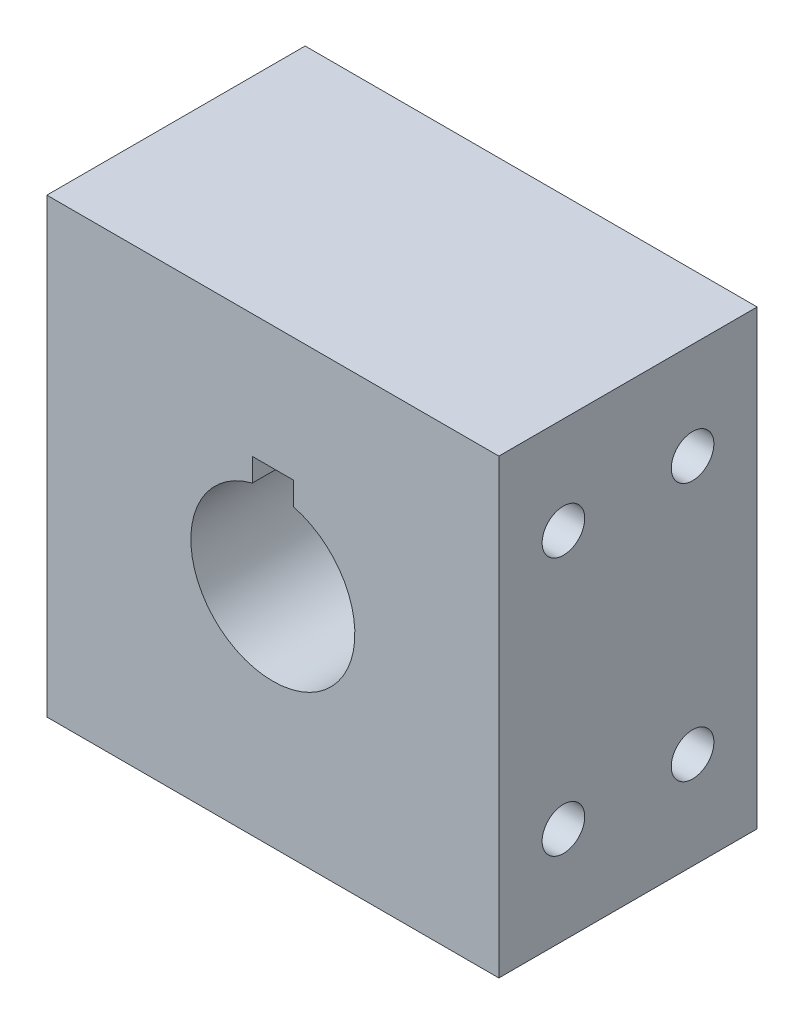
ISO-10303-21;
HEADER;
FILE_DESCRIPTION(('STEP AP214'),'2;1');
FILE_NAME('part.step','',(''),(''),'','','');
FILE_SCHEMA(('AUTOMOTIVE_DESIGN { 1 0 10303 214 1 1 1 1 }'));
ENDSEC;
DATA;
#1=APPLICATION_CONTEXT('core data for automotive mechanical design processes');
#2=APPLICATION_PROTOCOL_DEFINITION('international standard','automotive_design',2000,#1);
#3=PRODUCT_CONTEXT('',#1,'mechanical');
#4=PRODUCT('Part','Part','',(#3));
#5=PRODUCT_RELATED_PRODUCT_CATEGORY('part','',(#4));
#6=PRODUCT_DEFINITION_FORMATION('','',#4);
#7=PRODUCT_DEFINITION_CONTEXT('part definition',#1,'design');
#8=PRODUCT_DEFINITION('design','',#6,#7);
#9=PRODUCT_DEFINITION_SHAPE('','',#8);
#10=(LENGTH_UNIT() NAMED_UNIT(*) SI_UNIT(.MILLI.,.METRE.));
#11=(NAMED_UNIT(*) PLANE_ANGLE_UNIT() SI_UNIT($,.RADIAN.));
#12=(NAMED_UNIT(*) SI_UNIT($,.STERADIAN.) SOLID_ANGLE_UNIT());
#13=UNCERTAINTY_MEASURE_WITH_UNIT(LENGTH_MEASURE(1.E-05),#10,'distance_accuracy_value','');
#14=(GEOMETRIC_REPRESENTATION_CONTEXT(3) GLOBAL_UNCERTAINTY_ASSIGNED_CONTEXT((#13)) GLOBAL_UNIT_ASSIGNED_CONTEXT((#10,
#11,#12)) REPRESENTATION_CONTEXT('',''));
#15=CARTESIAN_POINT('',(0.,0.,0.));
#16=DIRECTION('',(0.,0.,1.));
#17=DIRECTION('',(1.,0.,0.));
#18=AXIS2_PLACEMENT_3D('',#15,#16,#17);
#19=CARTESIAN_POINT('',(0.,0.,20.));
#20=DIRECTION('',(-1.,0.,0.));
#21=DIRECTION('',(0.,-1.,0.));
#22=AXIS2_PLACEMENT_3D('',#19,#20,#21);
#23=PLANE('',#22);
#24=CARTESIAN_POINT('',(0.,27.5,5.));
#25=DIRECTION('',(1.,0.,0.));
#26=DIRECTION('',(0.,0.,-1.));
#27=AXIS2_PLACEMENT_3D('',#24,#25,#26);
#28=CIRCLE('',#27,1.64999999999999);
#29=CARTESIAN_POINT('',(0.,27.5,3.35000000000001));
#30=VERTEX_POINT('',#29);
#31=EDGE_CURVE('E136',#30,#30,#28,.T.);
#32=ORIENTED_EDGE('',*,*,#31,.F.);
#33=EDGE_LOOP('',(#32));
#34=FACE_BOUND('',#33,.T.);
#35=CARTESIAN_POINT('',(0.,7.5,15.));
#36=DIRECTION('',(1.,0.,0.));
#37=DIRECTION('',(0.,0.,-1.));
#38=AXIS2_PLACEMENT_3D('',#35,#36,#37);
#39=CIRCLE('',#38,1.64999999999999);
#40=CARTESIAN_POINT('',(0.,7.5,13.35));
#41=VERTEX_POINT('',#40);
#42=EDGE_CURVE('E135',#41,#41,#39,.T.);
#43=ORIENTED_EDGE('',*,*,#42,.F.);
#44=EDGE_LOOP('',(#43));
#45=FACE_BOUND('',#44,.T.);
#46=CARTESIAN_POINT('',(0.,7.5,5.));
#47=DIRECTION('',(1.,0.,0.));
#48=DIRECTION('',(0.,0.,-1.));
#49=AXIS2_PLACEMENT_3D('',#46,#47,#48);
#50=CIRCLE('',#49,1.64999999999999);
#51=CARTESIAN_POINT('',(0.,7.5,3.35000000000001));
#52=VERTEX_POINT('',#51);
#53=EDGE_CURVE('E146',#52,#52,#50,.T.);
#54=ORIENTED_EDGE('',*,*,#53,.F.);
#55=EDGE_LOOP('',(#54));
#56=FACE_BOUND('',#55,.T.);
#57=CARTESIAN_POINT('',(0.,27.5,15.));
#58=DIRECTION('',(1.,0.,0.));
#59=DIRECTION('',(0.,0.,-1.));
#60=AXIS2_PLACEMENT_3D('',#57,#58,#59);
#61=CIRCLE('',#60,1.64999999999999);
#62=CARTESIAN_POINT('',(0.,27.5,13.35));
#63=VERTEX_POINT('',#62);
#64=EDGE_CURVE('E152',#63,#63,#61,.T.);
#65=ORIENTED_EDGE('',*,*,#64,.F.);
#66=EDGE_LOOP('',(#65));
#67=FACE_BOUND('',#66,.T.);
#68=DIRECTION('',(0.,1.,0.));
#69=VECTOR('',#68,1.);
#70=CARTESIAN_POINT('',(0.,0.,0.));
#71=LINE('',#70,#69);
#72=CARTESIAN_POINT('',(0.,0.,0.));
#73=VERTEX_POINT('',#72);
#74=CARTESIAN_POINT('',(0.,35.,0.));
#75=VERTEX_POINT('',#74);
#76=EDGE_CURVE('E205',#73,#75,#71,.T.);
#77=ORIENTED_EDGE('',*,*,#76,.T.);
#78=DIRECTION('',(0.,0.,-1.));
#79=VECTOR('',#78,1.);
#80=CARTESIAN_POINT('',(0.,35.,20.));
#81=LINE('',#80,#79);
#82=CARTESIAN_POINT('',(0.,35.,20.));
#83=VERTEX_POINT('',#82);
#84=EDGE_CURVE('E11',#83,#75,#81,.T.);
#85=ORIENTED_EDGE('',*,*,#84,.F.);
#86=DIRECTION('',(0.,1.,0.));
#87=VECTOR('',#86,1.);
#88=CARTESIAN_POINT('',(0.,0.,20.));
#89=LINE('',#88,#87);
#90=CARTESIAN_POINT('',(0.,0.,20.));
#91=VERTEX_POINT('',#90);
#92=EDGE_CURVE('E210',#91,#83,#89,.T.);
#93=ORIENTED_EDGE('',*,*,#92,.F.);
#94=DIRECTION('',(0.,0.,-1.));
#95=VECTOR('',#94,1.);
#96=CARTESIAN_POINT('',(0.,0.,20.));
#97=LINE('',#96,#95);
#98=EDGE_CURVE('E220',#91,#73,#97,.T.);
#99=ORIENTED_EDGE('',*,*,#98,.T.);
#100=EDGE_LOOP('',(#77,#85,#93,#99));
#101=FACE_BOUND('',#100,.T.);
#102=ADVANCED_FACE('F38',(#34,#45,#56,#67,#101),#23,.F.);
#103=CARTESIAN_POINT('',(0.,35.,20.));
#104=DIRECTION('',(0.,-1.,0.));
#105=DIRECTION('',(1.,0.,0.));
#106=AXIS2_PLACEMENT_3D('',#103,#104,#105);
#107=PLANE('',#106);
#108=DIRECTION('',(-1.,0.,0.));
#109=VECTOR('',#108,1.);
#110=CARTESIAN_POINT('',(0.,35.,0.));
#111=LINE('',#110,#109);
#112=CARTESIAN_POINT('',(-35.,35.,0.));
#113=VERTEX_POINT('',#112);
#114=EDGE_CURVE('E223',#75,#113,#111,.T.);
#115=ORIENTED_EDGE('',*,*,#114,.T.);
#116=DIRECTION('',(0.,0.,-1.));
#117=VECTOR('',#116,1.);
#118=CARTESIAN_POINT('',(-35.,35.,20.));
#119=LINE('',#118,#117);
#120=CARTESIAN_POINT('',(-35.,35.,20.));
#121=VERTEX_POINT('',#120);
#122=EDGE_CURVE('E45',#121,#113,#119,.T.);
#123=ORIENTED_EDGE('',*,*,#122,.F.);
#124=DIRECTION('',(-1.,0.,0.));
#125=VECTOR('',#124,1.);
#126=CARTESIAN_POINT('',(0.,35.,20.));
#127=LINE('',#126,#125);
#128=EDGE_CURVE('E213',#83,#121,#127,.T.);
#129=ORIENTED_EDGE('',*,*,#128,.F.);
#130=ORIENTED_EDGE('',*,*,#84,.T.);
#131=EDGE_LOOP('',(#115,#123,#129,#130));
#132=FACE_BOUND('',#131,.T.);
#133=ADVANCED_FACE('F253',(#132),#107,.F.);
#134=CARTESIAN_POINT('',(-35.,0.,20.));
#135=DIRECTION('',(1.,0.,0.));
#136=DIRECTION('',(0.,0.,-1.));
#137=AXIS2_PLACEMENT_3D('',#134,#135,#136);
#138=PLANE('',#137);
#139=CARTESIAN_POINT('',(-35.,27.5,5.));
#140=DIRECTION('',(-1.,0.,0.));
#141=DIRECTION('',(0.,0.,1.));
#142=AXIS2_PLACEMENT_3D('',#139,#140,#141);
#143=CIRCLE('',#142,1.64999999999999);
#144=CARTESIAN_POINT('',(-35.,27.5,6.64999999999999));
#145=VERTEX_POINT('',#144);
#146=EDGE_CURVE('E158',#145,#145,#143,.T.);
#147=ORIENTED_EDGE('',*,*,#146,.F.);
#148=EDGE_LOOP('',(#147));
#149=FACE_BOUND('',#148,.T.);
#150=CARTESIAN_POINT('',(-35.,7.5,15.));
#151=DIRECTION('',(-1.,0.,0.));
#152=DIRECTION('',(0.,0.,1.));
#153=AXIS2_PLACEMENT_3D('',#150,#151,#152);
#154=CIRCLE('',#153,1.64999999999999);
#155=CARTESIAN_POINT('',(-35.,7.5,16.65));
#156=VERTEX_POINT('',#155);
#157=EDGE_CURVE('E164',#156,#156,#154,.T.);
#158=ORIENTED_EDGE('',*,*,#157,.F.);
#159=EDGE_LOOP('',(#158));
#160=FACE_BOUND('',#159,.T.);
#161=CARTESIAN_POINT('',(-35.,7.5,5.));
#162=DIRECTION('',(-1.,0.,0.));
#163=DIRECTION('',(0.,0.,1.));
#164=AXIS2_PLACEMENT_3D('',#161,#162,#163);
#165=CIRCLE('',#164,1.64999999999999);
#166=CARTESIAN_POINT('',(-35.,7.5,6.64999999999999));
#167=VERTEX_POINT('',#166);
#168=EDGE_CURVE('E170',#167,#167,#165,.T.);
#169=ORIENTED_EDGE('',*,*,#168,.F.);
#170=EDGE_LOOP('',(#169));
#171=FACE_BOUND('',#170,.T.);
#172=CARTESIAN_POINT('',(-35.,27.5,15.));
#173=DIRECTION('',(-1.,0.,0.));
#174=DIRECTION('',(0.,0.,1.));
#175=AXIS2_PLACEMENT_3D('',#172,#173,#174);
#176=CIRCLE('',#175,1.64999999999999);
#177=CARTESIAN_POINT('',(-35.,27.5,16.65));
#178=VERTEX_POINT('',#177);
#179=EDGE_CURVE('E176',#178,#178,#176,.T.);
#180=ORIENTED_EDGE('',*,*,#179,.F.);
#181=EDGE_LOOP('',(#180));
#182=FACE_BOUND('',#181,.T.);
#183=DIRECTION('',(0.,-1.,0.));
#184=VECTOR('',#183,1.);
#185=CARTESIAN_POINT('',(-35.,0.,0.));
#186=LINE('',#185,#184);
#187=CARTESIAN_POINT('',(-35.,0.,0.));
#188=VERTEX_POINT('',#187);
#189=EDGE_CURVE('E225',#113,#188,#186,.T.);
#190=ORIENTED_EDGE('',*,*,#189,.T.);
#191=DIRECTION('',(0.,0.,-1.));
#192=VECTOR('',#191,1.);
#193=CARTESIAN_POINT('',(-35.,0.,20.));
#194=LINE('',#193,#192);
#195=CARTESIAN_POINT('',(-35.,0.,20.));
#196=VERTEX_POINT('',#195);
#197=EDGE_CURVE('E230',#196,#188,#194,.T.);
#198=ORIENTED_EDGE('',*,*,#197,.F.);
#199=DIRECTION('',(0.,-1.,0.));
#200=VECTOR('',#199,1.);
#201=CARTESIAN_POINT('',(-35.,0.,20.));
#202=LINE('',#201,#200);
#203=EDGE_CURVE('E216',#121,#196,#202,.T.);
#204=ORIENTED_EDGE('',*,*,#203,.F.);
#205=ORIENTED_EDGE('',*,*,#122,.T.);
#206=EDGE_LOOP('',(#190,#198,#204,#205));
#207=FACE_BOUND('',#206,.T.);
#208=ADVANCED_FACE('F237',(#149,#160,#171,#182,#207),#138,.F.);
#209=CARTESIAN_POINT('',(0.,0.,20.));
#210=DIRECTION('',(0.,1.,0.));
#211=DIRECTION('',(0.,0.,1.));
#212=AXIS2_PLACEMENT_3D('',#209,#210,#211);
#213=PLANE('',#212);
#214=DIRECTION('',(1.,0.,0.));
#215=VECTOR('',#214,1.);
#216=CARTESIAN_POINT('',(0.,0.,0.));
#217=LINE('',#216,#215);
#218=EDGE_CURVE('E214',#188,#73,#217,.T.);
#219=ORIENTED_EDGE('',*,*,#218,.T.);
#220=ORIENTED_EDGE('',*,*,#98,.F.);
#221=DIRECTION('',(1.,0.,0.));
#222=VECTOR('',#221,1.);
#223=CARTESIAN_POINT('',(0.,0.,20.));
#224=LINE('',#223,#222);
#225=EDGE_CURVE('E218',#196,#91,#224,.T.);
#226=ORIENTED_EDGE('',*,*,#225,.F.);
#227=ORIENTED_EDGE('',*,*,#197,.T.);
#228=EDGE_LOOP('',(#219,#220,#226,#227));
#229=FACE_BOUND('',#228,.T.);
#230=ADVANCED_FACE('F246',(#229),#213,.F.);
#231=CARTESIAN_POINT('',(0.,0.,20.));
#232=DIRECTION('',(0.,0.,1.));
#233=DIRECTION('',(1.,0.,0.));
#234=AXIS2_PLACEMENT_3D('',#231,#232,#233);
#235=PLANE('',#234);
#236=CARTESIAN_POINT('',(-17.5,17.5,20.));
#237=DIRECTION('',(0.,0.,1.));
#238=DIRECTION('',(1.,0.,0.));
#239=AXIS2_PLACEMENT_3D('',#236,#237,#238);
#240=CIRCLE('',#239,6.35);
#241=CARTESIAN_POINT('',(-19.0875,23.6483610621043,20.));
#242=VERTEX_POINT('',#241);
#243=CARTESIAN_POINT('',(-15.9125,23.6483610621043,20.));
#244=VERTEX_POINT('',#243);
#245=EDGE_CURVE('E52',#242,#244,#240,.T.);
#246=ORIENTED_EDGE('',*,*,#245,.F.);
#247=DIRECTION('',(0.,-1.,0.));
#248=VECTOR('',#247,1.);
#249=CARTESIAN_POINT('',(-19.0875,0.,20.));
#250=LINE('',#249,#248);
#251=CARTESIAN_POINT('',(-19.0875,25.4375,20.));
#252=VERTEX_POINT('',#251);
#253=EDGE_CURVE('E186',#252,#242,#250,.T.);
#254=ORIENTED_EDGE('',*,*,#253,.F.);
#255=DIRECTION('',(1.,0.,0.));
#256=VECTOR('',#255,1.);
#257=CARTESIAN_POINT('',(0.,25.4375,20.));
#258=LINE('',#257,#256);
#259=CARTESIAN_POINT('',(-15.9125,25.4375,20.));
#260=VERTEX_POINT('',#259);
#261=EDGE_CURVE('E198',#252,#260,#258,.T.);
#262=ORIENTED_EDGE('',*,*,#261,.T.);
#263=DIRECTION('',(0.,-1.,0.));
#264=VECTOR('',#263,1.);
#265=CARTESIAN_POINT('',(-15.9125,0.,20.));
#266=LINE('',#265,#264);
#267=EDGE_CURVE('E195',#260,#244,#266,.T.);
#268=ORIENTED_EDGE('',*,*,#267,.T.);
#269=EDGE_LOOP('',(#246,#254,#262,#268));
#270=FACE_BOUND('',#269,.T.);
#271=ORIENTED_EDGE('',*,*,#92,.T.);
#272=ORIENTED_EDGE('',*,*,#128,.T.);
#273=ORIENTED_EDGE('',*,*,#203,.T.);
#274=ORIENTED_EDGE('',*,*,#225,.T.);
#275=EDGE_LOOP('',(#271,#272,#273,#274));
#276=FACE_BOUND('',#275,.T.);
#277=ADVANCED_FACE('F252',(#270,#276),#235,.T.);
#278=CARTESIAN_POINT('',(0.,0.,0.));
#279=DIRECTION('',(0.,0.,1.));
#280=DIRECTION('',(1.,0.,0.));
#281=AXIS2_PLACEMENT_3D('',#278,#279,#280);
#282=PLANE('',#281);
#283=DIRECTION('',(0.,-1.,0.));
#284=VECTOR('',#283,1.);
#285=CARTESIAN_POINT('',(-19.0875,0.,0.));
#286=LINE('',#285,#284);
#287=CARTESIAN_POINT('',(-19.0875,25.4375,0.));
#288=VERTEX_POINT('',#287);
#289=CARTESIAN_POINT('',(-19.0875,23.6483610621043,0.));
#290=VERTEX_POINT('',#289);
#291=EDGE_CURVE('E190',#288,#290,#286,.T.);
#292=ORIENTED_EDGE('',*,*,#291,.T.);
#293=CARTESIAN_POINT('',(-17.5,17.5,0.));
#294=DIRECTION('',(0.,0.,1.));
#295=DIRECTION('',(1.,0.,0.));
#296=AXIS2_PLACEMENT_3D('',#293,#294,#295);
#297=CIRCLE('',#296,6.35);
#298=CARTESIAN_POINT('',(-15.9125,23.6483610621043,0.));
#299=VERTEX_POINT('',#298);
#300=EDGE_CURVE('E182',#290,#299,#297,.T.);
#301=ORIENTED_EDGE('',*,*,#300,.T.);
#302=DIRECTION('',(0.,-1.,0.));
#303=VECTOR('',#302,1.);
#304=CARTESIAN_POINT('',(-15.9125,0.,0.));
#305=LINE('',#304,#303);
#306=CARTESIAN_POINT('',(-15.9125,25.4375,0.));
#307=VERTEX_POINT('',#306);
#308=EDGE_CURVE('E185',#307,#299,#305,.T.);
#309=ORIENTED_EDGE('',*,*,#308,.F.);
#310=DIRECTION('',(1.,0.,0.));
#311=VECTOR('',#310,1.);
#312=CARTESIAN_POINT('',(0.,25.4375,0.));
#313=LINE('',#312,#311);
#314=EDGE_CURVE('E188',#288,#307,#313,.T.);
#315=ORIENTED_EDGE('',*,*,#314,.F.);
#316=EDGE_LOOP('',(#292,#301,#309,#315));
#317=FACE_BOUND('',#316,.T.);
#318=ORIENTED_EDGE('',*,*,#76,.F.);
#319=ORIENTED_EDGE('',*,*,#218,.F.);
#320=ORIENTED_EDGE('',*,*,#189,.F.);
#321=ORIENTED_EDGE('',*,*,#114,.F.);
#322=EDGE_LOOP('',(#318,#319,#320,#321));
#323=FACE_BOUND('',#322,.T.);
#324=ADVANCED_FACE('F243',(#317,#323),#282,.F.);
#325=CARTESIAN_POINT('',(-17.5,17.5,0.));
#326=DIRECTION('',(0.,0.,1.));
#327=DIRECTION('',(1.,0.,0.));
#328=AXIS2_PLACEMENT_3D('',#325,#326,#327);
#329=CYLINDRICAL_SURFACE('',#328,6.35);
#330=ORIENTED_EDGE('',*,*,#245,.T.);
#331=DIRECTION('',(0.,0.,1.));
#332=VECTOR('',#331,1.);
#333=CARTESIAN_POINT('',(-15.9125,23.6483610621043,0.));
#334=LINE('',#333,#332);
#335=EDGE_CURVE('E193',#299,#244,#334,.T.);
#336=ORIENTED_EDGE('',*,*,#335,.F.);
#337=ORIENTED_EDGE('',*,*,#300,.F.);
#338=DIRECTION('',(0.,0.,1.));
#339=VECTOR('',#338,1.);
#340=CARTESIAN_POINT('',(-19.0875,23.6483610621043,0.));
#341=LINE('',#340,#339);
#342=EDGE_CURVE('E203',#290,#242,#341,.T.);
#343=ORIENTED_EDGE('',*,*,#342,.T.);
#344=EDGE_LOOP('',(#330,#336,#337,#343));
#345=FACE_BOUND('',#344,.T.);
#346=ADVANCED_FACE('F267',(#345),#329,.F.);
#347=CARTESIAN_POINT('',(-19.0875,0.,0.));
#348=DIRECTION('',(-1.,0.,0.));
#349=DIRECTION('',(0.,0.,1.));
#350=AXIS2_PLACEMENT_3D('',#347,#348,#349);
#351=PLANE('',#350);
#352=ORIENTED_EDGE('',*,*,#253,.T.);
#353=ORIENTED_EDGE('',*,*,#342,.F.);
#354=ORIENTED_EDGE('',*,*,#291,.F.);
#355=DIRECTION('',(0.,0.,1.));
#356=VECTOR('',#355,1.);
#357=CARTESIAN_POINT('',(-19.0875,25.4375,0.));
#358=LINE('',#357,#356);
#359=EDGE_CURVE('E206',#288,#252,#358,.T.);
#360=ORIENTED_EDGE('',*,*,#359,.T.);
#361=EDGE_LOOP('',(#352,#353,#354,#360));
#362=FACE_BOUND('',#361,.T.);
#363=ADVANCED_FACE('F274',(#362),#351,.F.);
#364=CARTESIAN_POINT('',(0.,25.4375,0.));
#365=DIRECTION('',(0.,-1.,0.));
#366=DIRECTION('',(0.,0.,-1.));
#367=AXIS2_PLACEMENT_3D('',#364,#365,#366);
#368=PLANE('',#367);
#369=ORIENTED_EDGE('',*,*,#261,.F.);
#370=ORIENTED_EDGE('',*,*,#359,.F.);
#371=ORIENTED_EDGE('',*,*,#314,.T.);
#372=DIRECTION('',(0.,0.,1.));
#373=VECTOR('',#372,1.);
#374=CARTESIAN_POINT('',(-15.9125,25.4375,0.));
#375=LINE('',#374,#373);
#376=EDGE_CURVE('E60',#307,#260,#375,.T.);
#377=ORIENTED_EDGE('',*,*,#376,.T.);
#378=EDGE_LOOP('',(#369,#370,#371,#377));
#379=FACE_BOUND('',#378,.T.);
#380=ADVANCED_FACE('F279',(#379),#368,.T.);
#381=CARTESIAN_POINT('',(-15.9125,0.,0.));
#382=DIRECTION('',(-1.,0.,0.));
#383=DIRECTION('',(0.,0.,1.));
#384=AXIS2_PLACEMENT_3D('',#381,#382,#383);
#385=PLANE('',#384);
#386=ORIENTED_EDGE('',*,*,#267,.F.);
#387=ORIENTED_EDGE('',*,*,#376,.F.);
#388=ORIENTED_EDGE('',*,*,#308,.T.);
#389=ORIENTED_EDGE('',*,*,#335,.T.);
#390=EDGE_LOOP('',(#386,#387,#388,#389));
#391=FACE_BOUND('',#390,.T.);
#392=ADVANCED_FACE('F275',(#391),#385,.T.);
#393=CARTESIAN_POINT('',(-25.,27.5,15.));
#394=DIRECTION('',(-1.,0.,0.));
#395=DIRECTION('',(0.,0.,1.));
#396=AXIS2_PLACEMENT_3D('',#393,#394,#395);
#397=CONICAL_SURFACE('',#396,1.64999999999999,1.02974425867665);
#398=CARTESIAN_POINT('',(-24.0085799786045,27.5,15.));
#399=VERTEX_POINT('',#398);
#400=VERTEX_LOOP('',#399);
#401=FACE_BOUND('',#400,.T.);
#402=CARTESIAN_POINT('',(-25.,27.5,15.));
#403=DIRECTION('',(-1.,0.,0.));
#404=DIRECTION('',(0.,0.,1.));
#405=AXIS2_PLACEMENT_3D('',#402,#403,#404);
#406=CIRCLE('',#405,1.64999999999999);
#407=CARTESIAN_POINT('',(-25.,27.5,16.65));
#408=VERTEX_POINT('',#407);
#409=EDGE_CURVE('E179',#408,#408,#406,.T.);
#410=ORIENTED_EDGE('',*,*,#409,.T.);
#411=EDGE_LOOP('',(#410));
#412=FACE_BOUND('',#411,.T.);
#413=ADVANCED_FACE('F278',(#401,#412),#397,.F.);
#414=CARTESIAN_POINT('',(-35.,27.5,15.));
#415=DIRECTION('',(-1.,0.,0.));
#416=DIRECTION('',(0.,0.,1.));
#417=AXIS2_PLACEMENT_3D('',#414,#415,#416);
#418=CYLINDRICAL_SURFACE('',#417,1.64999999999999);
#419=ORIENTED_EDGE('',*,*,#409,.F.);
#420=EDGE_LOOP('',(#419));
#421=FACE_BOUND('',#420,.T.);
#422=ORIENTED_EDGE('',*,*,#179,.T.);
#423=EDGE_LOOP('',(#422));
#424=FACE_BOUND('',#423,.T.);
#425=ADVANCED_FACE('F288',(#421,#424),#418,.F.);
#426=CARTESIAN_POINT('',(-25.,7.5,5.));
#427=DIRECTION('',(-1.,0.,0.));
#428=DIRECTION('',(0.,0.,1.));
#429=AXIS2_PLACEMENT_3D('',#426,#427,#428);
#430=CONICAL_SURFACE('',#429,1.64999999999999,1.02974425867665);
#431=CARTESIAN_POINT('',(-24.0085799786045,7.5,5.));
#432=VERTEX_POINT('',#431);
#433=VERTEX_LOOP('',#432);
#434=FACE_BOUND('',#433,.T.);
#435=CARTESIAN_POINT('',(-25.,7.5,5.));
#436=DIRECTION('',(-1.,0.,0.));
#437=DIRECTION('',(0.,0.,1.));
#438=AXIS2_PLACEMENT_3D('',#435,#436,#437);
#439=CIRCLE('',#438,1.64999999999999);
#440=CARTESIAN_POINT('',(-25.,7.5,6.64999999999998));
#441=VERTEX_POINT('',#440);
#442=EDGE_CURVE('E173',#441,#441,#439,.T.);
#443=ORIENTED_EDGE('',*,*,#442,.T.);
#444=EDGE_LOOP('',(#443));
#445=FACE_BOUND('',#444,.T.);
#446=ADVANCED_FACE('F292',(#434,#445),#430,.F.);
#447=CARTESIAN_POINT('',(-35.,7.5,5.));
#448=DIRECTION('',(-1.,0.,0.));
#449=DIRECTION('',(0.,0.,1.));
#450=AXIS2_PLACEMENT_3D('',#447,#448,#449);
#451=CYLINDRICAL_SURFACE('',#450,1.64999999999999);
#452=ORIENTED_EDGE('',*,*,#442,.F.);
#453=EDGE_LOOP('',(#452));
#454=FACE_BOUND('',#453,.T.);
#455=ORIENTED_EDGE('',*,*,#168,.T.);
#456=EDGE_LOOP('',(#455));
#457=FACE_BOUND('',#456,.T.);
#458=ADVANCED_FACE('F296',(#454,#457),#451,.F.);
#459=CARTESIAN_POINT('',(-25.,7.5,15.));
#460=DIRECTION('',(-1.,0.,0.));
#461=DIRECTION('',(0.,0.,1.));
#462=AXIS2_PLACEMENT_3D('',#459,#460,#461);
#463=CONICAL_SURFACE('',#462,1.64999999999999,1.02974425867665);
#464=CARTESIAN_POINT('',(-24.0085799786045,7.5,15.));
#465=VERTEX_POINT('',#464);
#466=VERTEX_LOOP('',#465);
#467=FACE_BOUND('',#466,.T.);
#468=CARTESIAN_POINT('',(-25.,7.5,15.));
#469=DIRECTION('',(-1.,0.,0.));
#470=DIRECTION('',(0.,0.,1.));
#471=AXIS2_PLACEMENT_3D('',#468,#469,#470);
#472=CIRCLE('',#471,1.64999999999999);
#473=CARTESIAN_POINT('',(-25.,7.5,16.65));
#474=VERTEX_POINT('',#473);
#475=EDGE_CURVE('E167',#474,#474,#472,.T.);
#476=ORIENTED_EDGE('',*,*,#475,.T.);
#477=EDGE_LOOP('',(#476));
#478=FACE_BOUND('',#477,.T.);
#479=ADVANCED_FACE('F300',(#467,#478),#463,.F.);
#480=CARTESIAN_POINT('',(-35.,7.5,15.));
#481=DIRECTION('',(-1.,0.,0.));
#482=DIRECTION('',(0.,0.,1.));
#483=AXIS2_PLACEMENT_3D('',#480,#481,#482);
#484=CYLINDRICAL_SURFACE('',#483,1.64999999999999);
#485=ORIENTED_EDGE('',*,*,#475,.F.);
#486=EDGE_LOOP('',(#485));
#487=FACE_BOUND('',#486,.T.);
#488=ORIENTED_EDGE('',*,*,#157,.T.);
#489=EDGE_LOOP('',(#488));
#490=FACE_BOUND('',#489,.T.);
#491=ADVANCED_FACE('F304',(#487,#490),#484,.F.);
#492=CARTESIAN_POINT('',(-25.,27.5,5.));
#493=DIRECTION('',(-1.,0.,0.));
#494=DIRECTION('',(0.,0.,1.));
#495=AXIS2_PLACEMENT_3D('',#492,#493,#494);
#496=CONICAL_SURFACE('',#495,1.64999999999999,1.02974425867665);
#497=CARTESIAN_POINT('',(-24.0085799786045,27.5,5.));
#498=VERTEX_POINT('',#497);
#499=VERTEX_LOOP('',#498);
#500=FACE_BOUND('',#499,.T.);
#501=CARTESIAN_POINT('',(-25.,27.5,5.));
#502=DIRECTION('',(-1.,0.,0.));
#503=DIRECTION('',(0.,0.,1.));
#504=AXIS2_PLACEMENT_3D('',#501,#502,#503);
#505=CIRCLE('',#504,1.64999999999999);
#506=CARTESIAN_POINT('',(-25.,27.5,6.64999999999999));
#507=VERTEX_POINT('',#506);
#508=EDGE_CURVE('E161',#507,#507,#505,.T.);
#509=ORIENTED_EDGE('',*,*,#508,.T.);
#510=EDGE_LOOP('',(#509));
#511=FACE_BOUND('',#510,.T.);
#512=ADVANCED_FACE('F308',(#500,#511),#496,.F.);
#513=CARTESIAN_POINT('',(-35.,27.5,5.));
#514=DIRECTION('',(-1.,0.,0.));
#515=DIRECTION('',(0.,0.,1.));
#516=AXIS2_PLACEMENT_3D('',#513,#514,#515);
#517=CYLINDRICAL_SURFACE('',#516,1.64999999999999);
#518=ORIENTED_EDGE('',*,*,#508,.F.);
#519=EDGE_LOOP('',(#518));
#520=FACE_BOUND('',#519,.T.);
#521=ORIENTED_EDGE('',*,*,#146,.T.);
#522=EDGE_LOOP('',(#521));
#523=FACE_BOUND('',#522,.T.);
#524=ADVANCED_FACE('F312',(#520,#523),#517,.F.);
#525=CARTESIAN_POINT('',(-9.99999999999999,27.5,15.));
#526=DIRECTION('',(1.,0.,0.));
#527=DIRECTION('',(0.,0.,-1.));
#528=AXIS2_PLACEMENT_3D('',#525,#526,#527);
#529=CONICAL_SURFACE('',#528,1.64999999999999,1.02974425867665);
#530=CARTESIAN_POINT('',(-10.9914200213955,27.5,15.));
#531=VERTEX_POINT('',#530);
#532=VERTEX_LOOP('',#531);
#533=FACE_BOUND('',#532,.T.);
#534=CARTESIAN_POINT('',(-9.99999999999999,27.5,15.));
#535=DIRECTION('',(1.,0.,0.));
#536=DIRECTION('',(0.,0.,-1.));
#537=AXIS2_PLACEMENT_3D('',#534,#535,#536);
#538=CIRCLE('',#537,1.64999999999999);
#539=CARTESIAN_POINT('',(-9.99999999999999,27.5,13.35));
#540=VERTEX_POINT('',#539);
#541=EDGE_CURVE('E155',#540,#540,#538,.T.);
#542=ORIENTED_EDGE('',*,*,#541,.T.);
#543=EDGE_LOOP('',(#542));
#544=FACE_BOUND('',#543,.T.);
#545=ADVANCED_FACE('F316',(#533,#544),#529,.F.);
#546=CARTESIAN_POINT('',(0.,27.5,15.));
#547=DIRECTION('',(1.,0.,0.));
#548=DIRECTION('',(0.,0.,-1.));
#549=AXIS2_PLACEMENT_3D('',#546,#547,#548);
#550=CYLINDRICAL_SURFACE('',#549,1.64999999999999);
#551=ORIENTED_EDGE('',*,*,#541,.F.);
#552=EDGE_LOOP('',(#551));
#553=FACE_BOUND('',#552,.T.);
#554=ORIENTED_EDGE('',*,*,#64,.T.);
#555=EDGE_LOOP('',(#554));
#556=FACE_BOUND('',#555,.T.);
#557=ADVANCED_FACE('F320',(#553,#556),#550,.F.);
#558=CARTESIAN_POINT('',(-9.99999999999999,7.5,5.));
#559=DIRECTION('',(1.,0.,0.));
#560=DIRECTION('',(0.,0.,-1.));
#561=AXIS2_PLACEMENT_3D('',#558,#559,#560);
#562=CONICAL_SURFACE('',#561,1.64999999999999,1.02974425867665);
#563=CARTESIAN_POINT('',(-10.9914200213955,7.5,5.));
#564=VERTEX_POINT('',#563);
#565=VERTEX_LOOP('',#564);
#566=FACE_BOUND('',#565,.T.);
#567=CARTESIAN_POINT('',(-9.99999999999999,7.5,5.));
#568=DIRECTION('',(1.,0.,0.));
#569=DIRECTION('',(0.,0.,-1.));
#570=AXIS2_PLACEMENT_3D('',#567,#568,#569);
#571=CIRCLE('',#570,1.64999999999999);
#572=CARTESIAN_POINT('',(-9.99999999999999,7.5,3.35000000000001));
#573=VERTEX_POINT('',#572);
#574=EDGE_CURVE('E149',#573,#573,#571,.T.);
#575=ORIENTED_EDGE('',*,*,#574,.T.);
#576=EDGE_LOOP('',(#575));
#577=FACE_BOUND('',#576,.T.);
#578=ADVANCED_FACE('F324',(#566,#577),#562,.F.);
#579=CARTESIAN_POINT('',(0.,7.5,5.));
#580=DIRECTION('',(1.,0.,0.));
#581=DIRECTION('',(0.,0.,-1.));
#582=AXIS2_PLACEMENT_3D('',#579,#580,#581);
#583=CYLINDRICAL_SURFACE('',#582,1.64999999999999);
#584=ORIENTED_EDGE('',*,*,#574,.F.);
#585=EDGE_LOOP('',(#584));
#586=FACE_BOUND('',#585,.T.);
#587=ORIENTED_EDGE('',*,*,#53,.T.);
#588=EDGE_LOOP('',(#587));
#589=FACE_BOUND('',#588,.T.);
#590=ADVANCED_FACE('F328',(#586,#589),#583,.F.);
#591=CARTESIAN_POINT('',(-9.99999999999999,7.5,15.));
#592=DIRECTION('',(1.,0.,0.));
#593=DIRECTION('',(0.,0.,-1.));
#594=AXIS2_PLACEMENT_3D('',#591,#592,#593);
#595=CONICAL_SURFACE('',#594,1.64999999999999,1.02974425867665);
#596=CARTESIAN_POINT('',(-10.9914200213955,7.5,15.));
#597=VERTEX_POINT('',#596);
#598=VERTEX_LOOP('',#597);
#599=FACE_BOUND('',#598,.T.);
#600=CARTESIAN_POINT('',(-9.99999999999999,7.5,15.));
#601=DIRECTION('',(1.,0.,0.));
#602=DIRECTION('',(0.,0.,-1.));
#603=AXIS2_PLACEMENT_3D('',#600,#601,#602);
#604=CIRCLE('',#603,1.64999999999999);
#605=CARTESIAN_POINT('',(-9.99999999999999,7.5,13.35));
#606=VERTEX_POINT('',#605);
#607=EDGE_CURVE('E139',#606,#606,#604,.T.);
#608=ORIENTED_EDGE('',*,*,#607,.T.);
#609=EDGE_LOOP('',(#608));
#610=FACE_BOUND('',#609,.T.);
#611=ADVANCED_FACE('F332',(#599,#610),#595,.F.);
#612=CARTESIAN_POINT('',(0.,7.5,15.));
#613=DIRECTION('',(1.,0.,0.));
#614=DIRECTION('',(0.,0.,-1.));
#615=AXIS2_PLACEMENT_3D('',#612,#613,#614);
#616=CYLINDRICAL_SURFACE('',#615,1.64999999999999);
#617=ORIENTED_EDGE('',*,*,#607,.F.);
#618=EDGE_LOOP('',(#617));
#619=FACE_BOUND('',#618,.T.);
#620=ORIENTED_EDGE('',*,*,#42,.T.);
#621=EDGE_LOOP('',(#620));
#622=FACE_BOUND('',#621,.T.);
#623=ADVANCED_FACE('F129',(#619,#622),#616,.F.);
#624=CARTESIAN_POINT('',(-9.99999999999999,27.5,5.));
#625=DIRECTION('',(1.,0.,0.));
#626=DIRECTION('',(0.,0.,-1.));
#627=AXIS2_PLACEMENT_3D('',#624,#625,#626);
#628=CONICAL_SURFACE('',#627,1.64999999999999,1.02974425867665);
#629=CARTESIAN_POINT('',(-10.9914200213955,27.5,5.));
#630=VERTEX_POINT('',#629);
#631=VERTEX_LOOP('',#630);
#632=FACE_BOUND('',#631,.T.);
#633=CARTESIAN_POINT('',(-9.99999999999999,27.5,5.));
#634=DIRECTION('',(1.,0.,0.));
#635=DIRECTION('',(0.,0.,-1.));
#636=AXIS2_PLACEMENT_3D('',#633,#634,#635);
#637=CIRCLE('',#636,1.64999999999999);
#638=CARTESIAN_POINT('',(-9.99999999999999,27.5,3.35000000000001));
#639=VERTEX_POINT('',#638);
#640=EDGE_CURVE('E133',#639,#639,#637,.T.);
#641=ORIENTED_EDGE('',*,*,#640,.T.);
#642=EDGE_LOOP('',(#641));
#643=FACE_BOUND('',#642,.T.);
#644=ADVANCED_FACE('F125',(#632,#643),#628,.F.);
#645=CARTESIAN_POINT('',(0.,27.5,5.));
#646=DIRECTION('',(1.,0.,0.));
#647=DIRECTION('',(0.,0.,-1.));
#648=AXIS2_PLACEMENT_3D('',#645,#646,#647);
#649=CYLINDRICAL_SURFACE('',#648,1.64999999999999);
#650=ORIENTED_EDGE('',*,*,#640,.F.);
#651=EDGE_LOOP('',(#650));
#652=FACE_BOUND('',#651,.T.);
#653=ORIENTED_EDGE('',*,*,#31,.T.);
#654=EDGE_LOOP('',(#653));
#655=FACE_BOUND('',#654,.T.);
#656=ADVANCED_FACE('F128',(#652,#655),#649,.F.);
#657=CLOSED_SHELL('',(#102,#133,#208,#230,#277,#324,#346,#363,#380,#392,#413,#425,#446,#458,
#479,#491,#512,#524,#545,#557,#578,#590,#611,#623,#644,#656));
#658=MANIFOLD_SOLID_BREP('B2',#657);
#659=ADVANCED_BREP_SHAPE_REPRESENTATION('',(#18,#658),#14);
#660=SHAPE_DEFINITION_REPRESENTATION(#9,#659);
ENDSEC;
END-ISO-10303-21;
